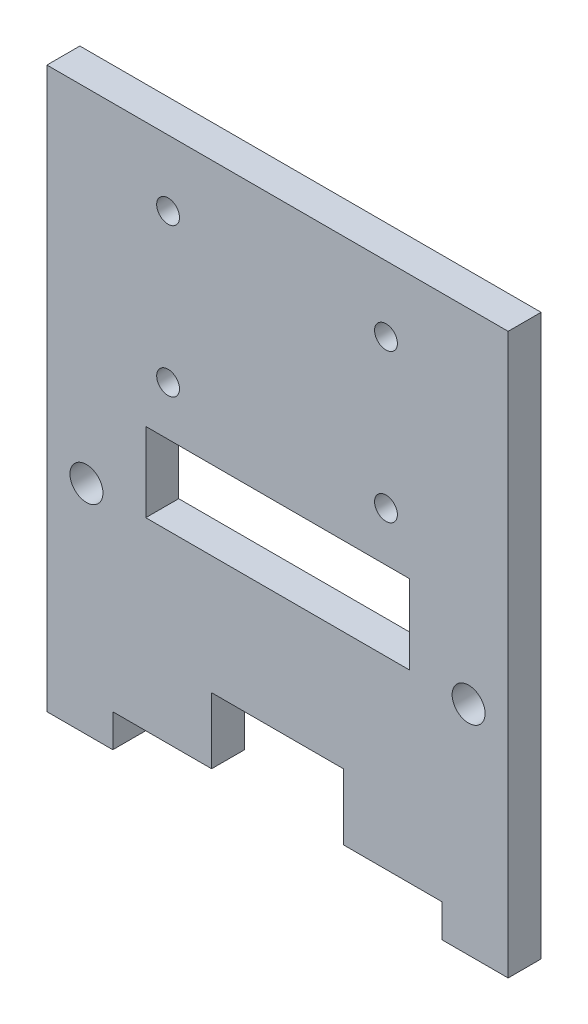
ISO-10303-21;
HEADER;
FILE_DESCRIPTION(('STEP AP214'),'2;1');
FILE_NAME('part.step','',(''),(''),'','','');
FILE_SCHEMA(('AUTOMOTIVE_DESIGN { 1 0 10303 214 1 1 1 1 }'));
ENDSEC;
DATA;
#1=APPLICATION_CONTEXT('core data for automotive mechanical design processes');
#2=APPLICATION_PROTOCOL_DEFINITION('international standard','automotive_design',2000,#1);
#3=PRODUCT_CONTEXT('',#1,'mechanical');
#4=PRODUCT('Part','Part','',(#3));
#5=PRODUCT_RELATED_PRODUCT_CATEGORY('part','',(#4));
#6=PRODUCT_DEFINITION_FORMATION('','',#4);
#7=PRODUCT_DEFINITION_CONTEXT('part definition',#1,'design');
#8=PRODUCT_DEFINITION('design','',#6,#7);
#9=PRODUCT_DEFINITION_SHAPE('','',#8);
#10=(LENGTH_UNIT() NAMED_UNIT(*) SI_UNIT(.MILLI.,.METRE.));
#11=(NAMED_UNIT(*) PLANE_ANGLE_UNIT() SI_UNIT($,.RADIAN.));
#12=(NAMED_UNIT(*) SI_UNIT($,.STERADIAN.) SOLID_ANGLE_UNIT());
#13=UNCERTAINTY_MEASURE_WITH_UNIT(LENGTH_MEASURE(1.E-05),#10,'distance_accuracy_value','');
#14=(GEOMETRIC_REPRESENTATION_CONTEXT(3) GLOBAL_UNCERTAINTY_ASSIGNED_CONTEXT((#13)) GLOBAL_UNIT_ASSIGNED_CONTEXT((#10,
#11,#12)) REPRESENTATION_CONTEXT('',''));
#15=CARTESIAN_POINT('',(0.,0.,0.));
#16=DIRECTION('',(0.,0.,1.));
#17=DIRECTION('',(1.,0.,0.));
#18=AXIS2_PLACEMENT_3D('',#15,#16,#17);
#19=CARTESIAN_POINT('',(6.35,3.175,0.));
#20=DIRECTION('',(0.,1.,0.));
#21=DIRECTION('',(0.,0.,1.));
#22=AXIS2_PLACEMENT_3D('',#19,#20,#21);
#23=PLANE('',#22);
#24=DIRECTION('',(-1.,0.,0.));
#25=VECTOR('',#24,1.);
#26=CARTESIAN_POINT('',(6.35,3.175,0.));
#27=LINE('',#26,#25);
#28=CARTESIAN_POINT('',(15.875,3.175,0.));
#29=VERTEX_POINT('',#28);
#30=CARTESIAN_POINT('',(6.35,3.175,0.));
#31=VERTEX_POINT('',#30);
#32=EDGE_CURVE('E241',#29,#31,#27,.T.);
#33=ORIENTED_EDGE('',*,*,#32,.F.);
#34=DIRECTION('',(0.,0.,1.));
#35=VECTOR('',#34,1.);
#36=CARTESIAN_POINT('',(15.875,3.175,0.));
#37=LINE('',#36,#35);
#38=CARTESIAN_POINT('',(15.875,3.175,3.175));
#39=VERTEX_POINT('',#38);
#40=EDGE_CURVE('E206',#29,#39,#37,.T.);
#41=ORIENTED_EDGE('',*,*,#40,.T.);
#42=DIRECTION('',(-1.,0.,0.));
#43=VECTOR('',#42,1.);
#44=CARTESIAN_POINT('',(6.35,3.175,3.175));
#45=LINE('',#44,#43);
#46=CARTESIAN_POINT('',(6.35,3.175,3.175));
#47=VERTEX_POINT('',#46);
#48=EDGE_CURVE('E252',#39,#47,#45,.T.);
#49=ORIENTED_EDGE('',*,*,#48,.T.);
#50=DIRECTION('',(0.,0.,1.));
#51=VECTOR('',#50,1.);
#52=CARTESIAN_POINT('',(6.35,3.175,0.));
#53=LINE('',#52,#51);
#54=EDGE_CURVE('E255',#31,#47,#53,.T.);
#55=ORIENTED_EDGE('',*,*,#54,.F.);
#56=EDGE_LOOP('',(#33,#41,#49,#55));
#57=FACE_BOUND('',#56,.T.);
#58=ADVANCED_FACE('F36',(#57),#23,.F.);
#59=CARTESIAN_POINT('',(0.,0.,3.175));
#60=DIRECTION('',(0.,1.,0.));
#61=DIRECTION('',(-1.,0.,0.));
#62=AXIS2_PLACEMENT_3D('',#59,#60,#61);
#63=PLANE('',#62);
#64=DIRECTION('',(1.,0.,0.));
#65=VECTOR('',#64,1.);
#66=CARTESIAN_POINT('',(0.,0.,0.));
#67=LINE('',#66,#65);
#68=CARTESIAN_POINT('',(0.,0.,0.));
#69=VERTEX_POINT('',#68);
#70=CARTESIAN_POINT('',(6.35,0.,0.));
#71=VERTEX_POINT('',#70);
#72=EDGE_CURVE('E281',#69,#71,#67,.T.);
#73=ORIENTED_EDGE('',*,*,#72,.T.);
#74=DIRECTION('',(0.,0.,1.));
#75=VECTOR('',#74,1.);
#76=CARTESIAN_POINT('',(6.35,0.,0.));
#77=LINE('',#76,#75);
#78=CARTESIAN_POINT('',(6.35,0.,3.175));
#79=VERTEX_POINT('',#78);
#80=EDGE_CURVE('E245',#71,#79,#77,.T.);
#81=ORIENTED_EDGE('',*,*,#80,.T.);
#82=DIRECTION('',(1.,0.,0.));
#83=VECTOR('',#82,1.);
#84=CARTESIAN_POINT('',(0.,0.,3.175));
#85=LINE('',#84,#83);
#86=CARTESIAN_POINT('',(0.,0.,3.175));
#87=VERTEX_POINT('',#86);
#88=EDGE_CURVE('E270',#87,#79,#85,.T.);
#89=ORIENTED_EDGE('',*,*,#88,.F.);
#90=DIRECTION('',(0.,0.,-1.));
#91=VECTOR('',#90,1.);
#92=CARTESIAN_POINT('',(0.,0.,3.175));
#93=LINE('',#92,#91);
#94=EDGE_CURVE('E11',#87,#69,#93,.T.);
#95=ORIENTED_EDGE('',*,*,#94,.T.);
#96=EDGE_LOOP('',(#73,#81,#89,#95));
#97=FACE_BOUND('',#96,.T.);
#98=ADVANCED_FACE('F343',(#97),#63,.F.);
#99=CARTESIAN_POINT('',(0.,0.,3.175));
#100=DIRECTION('',(1.,0.,0.));
#101=DIRECTION('',(0.,0.,-1.));
#102=AXIS2_PLACEMENT_3D('',#99,#100,#101);
#103=PLANE('',#102);
#104=DIRECTION('',(0.,-1.,0.));
#105=VECTOR('',#104,1.);
#106=CARTESIAN_POINT('',(0.,0.,0.));
#107=LINE('',#106,#105);
#108=CARTESIAN_POINT('',(0.,53.975,0.));
#109=VERTEX_POINT('',#108);
#110=EDGE_CURVE('E258',#109,#69,#107,.T.);
#111=ORIENTED_EDGE('',*,*,#110,.T.);
#112=ORIENTED_EDGE('',*,*,#94,.F.);
#113=DIRECTION('',(0.,-1.,0.));
#114=VECTOR('',#113,1.);
#115=CARTESIAN_POINT('',(0.,0.,3.175));
#116=LINE('',#115,#114);
#117=CARTESIAN_POINT('',(0.,53.975,3.175));
#118=VERTEX_POINT('',#117);
#119=EDGE_CURVE('E265',#118,#87,#116,.T.);
#120=ORIENTED_EDGE('',*,*,#119,.F.);
#121=DIRECTION('',(0.,0.,-1.));
#122=VECTOR('',#121,1.);
#123=CARTESIAN_POINT('',(0.,53.975,3.175));
#124=LINE('',#123,#122);
#125=EDGE_CURVE('E277',#118,#109,#124,.T.);
#126=ORIENTED_EDGE('',*,*,#125,.T.);
#127=EDGE_LOOP('',(#111,#112,#120,#126));
#128=FACE_BOUND('',#127,.T.);
#129=ADVANCED_FACE('F38',(#128),#103,.F.);
#130=CARTESIAN_POINT('',(38.1,0.,3.175));
#131=VERTEX_POINT('',#130);
#132=CARTESIAN_POINT('',(44.45,0.,3.175));
#133=VERTEX_POINT('',#132);
#134=EDGE_CURVE('E268',#131,#133,#85,.T.);
#135=ORIENTED_EDGE('',*,*,#134,.F.);
#136=DIRECTION('',(0.,0.,1.));
#137=VECTOR('',#136,1.);
#138=CARTESIAN_POINT('',(38.1,0.,0.));
#139=LINE('',#138,#137);
#140=CARTESIAN_POINT('',(38.1,0.,0.));
#141=VERTEX_POINT('',#140);
#142=EDGE_CURVE('E261',#141,#131,#139,.T.);
#143=ORIENTED_EDGE('',*,*,#142,.F.);
#144=CARTESIAN_POINT('',(44.45,0.,0.));
#145=VERTEX_POINT('',#144);
#146=EDGE_CURVE('E280',#141,#145,#67,.T.);
#147=ORIENTED_EDGE('',*,*,#146,.T.);
#148=DIRECTION('',(0.,0.,-1.));
#149=VECTOR('',#148,1.);
#150=CARTESIAN_POINT('',(44.45,0.,3.175));
#151=LINE('',#150,#149);
#152=EDGE_CURVE('E44',#133,#145,#151,.T.);
#153=ORIENTED_EDGE('',*,*,#152,.F.);
#154=EDGE_LOOP('',(#135,#143,#147,#153));
#155=FACE_BOUND('',#154,.T.);
#156=ADVANCED_FACE('F319',(#155),#63,.F.);
#157=CARTESIAN_POINT('',(44.45,0.,3.175));
#158=DIRECTION('',(-1.,0.,0.));
#159=DIRECTION('',(0.,0.,1.));
#160=AXIS2_PLACEMENT_3D('',#157,#158,#159);
#161=PLANE('',#160);
#162=DIRECTION('',(0.,1.,0.));
#163=VECTOR('',#162,1.);
#164=CARTESIAN_POINT('',(44.45,0.,0.));
#165=LINE('',#164,#163);
#166=CARTESIAN_POINT('',(44.45,53.975,0.));
#167=VERTEX_POINT('',#166);
#168=EDGE_CURVE('E284',#145,#167,#165,.T.);
#169=ORIENTED_EDGE('',*,*,#168,.T.);
#170=DIRECTION('',(0.,0.,-1.));
#171=VECTOR('',#170,1.);
#172=CARTESIAN_POINT('',(44.45,53.975,3.175));
#173=LINE('',#172,#171);
#174=CARTESIAN_POINT('',(44.45,53.975,3.175));
#175=VERTEX_POINT('',#174);
#176=EDGE_CURVE('E289',#175,#167,#173,.T.);
#177=ORIENTED_EDGE('',*,*,#176,.F.);
#178=DIRECTION('',(0.,1.,0.));
#179=VECTOR('',#178,1.);
#180=CARTESIAN_POINT('',(44.45,0.,3.175));
#181=LINE('',#180,#179);
#182=EDGE_CURVE('E273',#133,#175,#181,.T.);
#183=ORIENTED_EDGE('',*,*,#182,.F.);
#184=ORIENTED_EDGE('',*,*,#152,.T.);
#185=EDGE_LOOP('',(#169,#177,#183,#184));
#186=FACE_BOUND('',#185,.T.);
#187=ADVANCED_FACE('F296',(#186),#161,.F.);
#188=CARTESIAN_POINT('',(0.,53.975,3.175));
#189=DIRECTION('',(0.,-1.,0.));
#190=DIRECTION('',(0.,0.,-1.));
#191=AXIS2_PLACEMENT_3D('',#188,#189,#190);
#192=PLANE('',#191);
#193=DIRECTION('',(-1.,0.,0.));
#194=VECTOR('',#193,1.);
#195=CARTESIAN_POINT('',(0.,53.975,0.));
#196=LINE('',#195,#194);
#197=EDGE_CURVE('E269',#167,#109,#196,.T.);
#198=ORIENTED_EDGE('',*,*,#197,.T.);
#199=ORIENTED_EDGE('',*,*,#125,.F.);
#200=DIRECTION('',(-1.,0.,0.));
#201=VECTOR('',#200,1.);
#202=CARTESIAN_POINT('',(0.,53.975,3.175));
#203=LINE('',#202,#201);
#204=EDGE_CURVE('E275',#175,#118,#203,.T.);
#205=ORIENTED_EDGE('',*,*,#204,.F.);
#206=ORIENTED_EDGE('',*,*,#176,.T.);
#207=EDGE_LOOP('',(#198,#199,#205,#206));
#208=FACE_BOUND('',#207,.T.);
#209=ADVANCED_FACE('F307',(#208),#192,.F.);
#210=CARTESIAN_POINT('',(0.,0.,3.175));
#211=DIRECTION('',(0.,0.,-1.));
#212=DIRECTION('',(-1.,0.,0.));
#213=AXIS2_PLACEMENT_3D('',#210,#211,#212);
#214=PLANE('',#213);
#215=CARTESIAN_POINT('',(3.81,20.955,3.175));
#216=DIRECTION('',(0.,0.,1.));
#217=DIRECTION('',(1.,0.,0.));
#218=AXIS2_PLACEMENT_3D('',#215,#216,#217);
#219=CIRCLE('',#218,1.5875);
#220=CARTESIAN_POINT('',(5.3975,20.955,3.175));
#221=VERTEX_POINT('',#220);
#222=EDGE_CURVE('E191',#221,#221,#219,.T.);
#223=ORIENTED_EDGE('',*,*,#222,.F.);
#224=EDGE_LOOP('',(#223));
#225=FACE_BOUND('',#224,.T.);
#226=DIRECTION('',(1.,0.,0.));
#227=VECTOR('',#226,1.);
#228=CARTESIAN_POINT('',(9.52500000000001,20.955,3.175));
#229=LINE('',#228,#227);
#230=CARTESIAN_POINT('',(9.52500000000001,20.955,3.175));
#231=VERTEX_POINT('',#230);
#232=CARTESIAN_POINT('',(34.925,20.955,3.175));
#233=VERTEX_POINT('',#232);
#234=EDGE_CURVE('E179',#231,#233,#229,.T.);
#235=ORIENTED_EDGE('',*,*,#234,.F.);
#236=DIRECTION('',(0.,-1.,0.));
#237=VECTOR('',#236,1.);
#238=CARTESIAN_POINT('',(9.525,28.575,3.175));
#239=LINE('',#238,#237);
#240=CARTESIAN_POINT('',(9.525,28.575,3.175));
#241=VERTEX_POINT('',#240);
#242=EDGE_CURVE('E51',#241,#231,#239,.T.);
#243=ORIENTED_EDGE('',*,*,#242,.F.);
#244=DIRECTION('',(-1.,0.,0.));
#245=VECTOR('',#244,1.);
#246=CARTESIAN_POINT('',(9.525,28.575,3.175));
#247=LINE('',#246,#245);
#248=CARTESIAN_POINT('',(34.925,28.575,3.175));
#249=VERTEX_POINT('',#248);
#250=EDGE_CURVE('E167',#249,#241,#247,.T.);
#251=ORIENTED_EDGE('',*,*,#250,.F.);
#252=DIRECTION('',(0.,1.,0.));
#253=VECTOR('',#252,1.);
#254=CARTESIAN_POINT('',(34.925,28.575,3.175));
#255=LINE('',#254,#253);
#256=EDGE_CURVE('E170',#233,#249,#255,.T.);
#257=ORIENTED_EDGE('',*,*,#256,.F.);
#258=EDGE_LOOP('',(#235,#243,#251,#257));
#259=FACE_BOUND('',#258,.T.);
#260=CARTESIAN_POINT('',(32.6772125959636,33.325,3.175));
#261=DIRECTION('',(0.,0.,1.));
#262=DIRECTION('',(1.,0.,0.));
#263=AXIS2_PLACEMENT_3D('',#260,#261,#262);
#264=CIRCLE('',#263,1.1);
#265=CARTESIAN_POINT('',(33.7772125959636,33.325,3.175));
#266=VERTEX_POINT('',#265);
#267=EDGE_CURVE('E173',#266,#266,#264,.T.);
#268=ORIENTED_EDGE('',*,*,#267,.F.);
#269=EDGE_LOOP('',(#268));
#270=FACE_BOUND('',#269,.T.);
#271=CARTESIAN_POINT('',(32.6772125959636,47.625,3.175));
#272=DIRECTION('',(0.,0.,1.));
#273=DIRECTION('',(1.,0.,0.));
#274=AXIS2_PLACEMENT_3D('',#271,#272,#273);
#275=CIRCLE('',#274,1.1);
#276=CARTESIAN_POINT('',(33.7772125959636,47.625,3.175));
#277=VERTEX_POINT('',#276);
#278=EDGE_CURVE('E424',#277,#277,#275,.T.);
#279=ORIENTED_EDGE('',*,*,#278,.F.);
#280=EDGE_LOOP('',(#279));
#281=FACE_BOUND('',#280,.T.);
#282=CARTESIAN_POINT('',(11.6772125959636,33.325,3.175));
#283=DIRECTION('',(0.,0.,1.));
#284=DIRECTION('',(1.,0.,0.));
#285=AXIS2_PLACEMENT_3D('',#282,#283,#284);
#286=CIRCLE('',#285,1.1);
#287=CARTESIAN_POINT('',(12.7772125959636,33.325,3.175));
#288=VERTEX_POINT('',#287);
#289=EDGE_CURVE('E230',#288,#288,#286,.T.);
#290=ORIENTED_EDGE('',*,*,#289,.F.);
#291=EDGE_LOOP('',(#290));
#292=FACE_BOUND('',#291,.T.);
#293=CARTESIAN_POINT('',(11.6772125959636,47.625,3.175));
#294=DIRECTION('',(0.,0.,1.));
#295=DIRECTION('',(1.,0.,0.));
#296=AXIS2_PLACEMENT_3D('',#293,#294,#295);
#297=CIRCLE('',#296,1.1);
#298=CARTESIAN_POINT('',(12.7772125959636,47.625,3.175));
#299=VERTEX_POINT('',#298);
#300=EDGE_CURVE('E224',#299,#299,#297,.T.);
#301=ORIENTED_EDGE('',*,*,#300,.F.);
#302=EDGE_LOOP('',(#301));
#303=FACE_BOUND('',#302,.T.);
#304=CARTESIAN_POINT('',(40.64,20.955,3.175));
#305=DIRECTION('',(0.,0.,1.));
#306=DIRECTION('',(-1.,0.,0.));
#307=AXIS2_PLACEMENT_3D('',#304,#305,#306);
#308=CIRCLE('',#307,1.58750000000001);
#309=CARTESIAN_POINT('',(39.0525,20.955,3.175));
#310=VERTEX_POINT('',#309);
#311=EDGE_CURVE('E192',#310,#310,#308,.T.);
#312=ORIENTED_EDGE('',*,*,#311,.F.);
#313=EDGE_LOOP('',(#312));
#314=FACE_BOUND('',#313,.T.);
#315=ORIENTED_EDGE('',*,*,#48,.F.);
#316=DIRECTION('',(0.,-1.,0.));
#317=VECTOR('',#316,1.);
#318=CARTESIAN_POINT('',(15.875,3.175,3.175));
#319=LINE('',#318,#317);
#320=CARTESIAN_POINT('',(15.875,9.525,3.175));
#321=VERTEX_POINT('',#320);
#322=EDGE_CURVE('E207',#321,#39,#319,.T.);
#323=ORIENTED_EDGE('',*,*,#322,.F.);
#324=DIRECTION('',(-1.,0.,0.));
#325=VECTOR('',#324,1.);
#326=CARTESIAN_POINT('',(15.875,9.525,3.175));
#327=LINE('',#326,#325);
#328=CARTESIAN_POINT('',(28.575,9.525,3.175));
#329=VERTEX_POINT('',#328);
#330=EDGE_CURVE('E200',#329,#321,#327,.T.);
#331=ORIENTED_EDGE('',*,*,#330,.F.);
#332=DIRECTION('',(0.,1.,0.));
#333=VECTOR('',#332,1.);
#334=CARTESIAN_POINT('',(28.575,3.175,3.175));
#335=LINE('',#334,#333);
#336=CARTESIAN_POINT('',(28.575,3.175,3.175));
#337=VERTEX_POINT('',#336);
#338=EDGE_CURVE('E209',#337,#329,#335,.T.);
#339=ORIENTED_EDGE('',*,*,#338,.F.);
#340=CARTESIAN_POINT('',(38.1,3.175,3.175));
#341=VERTEX_POINT('',#340);
#342=EDGE_CURVE('E238',#341,#337,#45,.T.);
#343=ORIENTED_EDGE('',*,*,#342,.F.);
#344=DIRECTION('',(0.,1.,0.));
#345=VECTOR('',#344,1.);
#346=CARTESIAN_POINT('',(38.1,0.,3.175));
#347=LINE('',#346,#345);
#348=EDGE_CURVE('E248',#131,#341,#347,.T.);
#349=ORIENTED_EDGE('',*,*,#348,.F.);
#350=ORIENTED_EDGE('',*,*,#134,.T.);
#351=ORIENTED_EDGE('',*,*,#182,.T.);
#352=ORIENTED_EDGE('',*,*,#204,.T.);
#353=ORIENTED_EDGE('',*,*,#119,.T.);
#354=ORIENTED_EDGE('',*,*,#88,.T.);
#355=DIRECTION('',(0.,-1.,0.));
#356=VECTOR('',#355,1.);
#357=CARTESIAN_POINT('',(6.35,0.,3.175));
#358=LINE('',#357,#356);
#359=EDGE_CURVE('E246',#47,#79,#358,.T.);
#360=ORIENTED_EDGE('',*,*,#359,.F.);
#361=EDGE_LOOP('',(#315,#323,#331,#339,#343,#349,#350,#351,#352,#353,#354,#360));
#362=FACE_BOUND('',#361,.T.);
#363=ADVANCED_FACE('F314',(#225,#259,#270,#281,#292,#303,#314,#362),#214,.F.);
#364=CARTESIAN_POINT('',(0.,0.,0.));
#365=DIRECTION('',(0.,0.,-1.));
#366=DIRECTION('',(-1.,0.,0.));
#367=AXIS2_PLACEMENT_3D('',#364,#365,#366);
#368=PLANE('',#367);
#369=CARTESIAN_POINT('',(3.81,20.955,0.));
#370=DIRECTION('',(0.,0.,1.));
#371=DIRECTION('',(1.,0.,0.));
#372=AXIS2_PLACEMENT_3D('',#369,#370,#371);
#373=CIRCLE('',#372,1.5875);
#374=CARTESIAN_POINT('',(5.3975,20.955,0.));
#375=VERTEX_POINT('',#374);
#376=EDGE_CURVE('E249',#375,#375,#373,.T.);
#377=ORIENTED_EDGE('',*,*,#376,.T.);
#378=EDGE_LOOP('',(#377));
#379=FACE_BOUND('',#378,.T.);
#380=DIRECTION('',(0.,-1.,0.));
#381=VECTOR('',#380,1.);
#382=CARTESIAN_POINT('',(9.525,28.575,0.));
#383=LINE('',#382,#381);
#384=CARTESIAN_POINT('',(9.525,28.575,0.));
#385=VERTEX_POINT('',#384);
#386=CARTESIAN_POINT('',(9.52500000000001,20.955,0.));
#387=VERTEX_POINT('',#386);
#388=EDGE_CURVE('E151',#385,#387,#383,.T.);
#389=ORIENTED_EDGE('',*,*,#388,.T.);
#390=DIRECTION('',(1.,0.,0.));
#391=VECTOR('',#390,1.);
#392=CARTESIAN_POINT('',(9.52500000000001,20.955,0.));
#393=LINE('',#392,#391);
#394=CARTESIAN_POINT('',(34.925,20.955,0.));
#395=VERTEX_POINT('',#394);
#396=EDGE_CURVE('E160',#387,#395,#393,.T.);
#397=ORIENTED_EDGE('',*,*,#396,.T.);
#398=DIRECTION('',(0.,1.,0.));
#399=VECTOR('',#398,1.);
#400=CARTESIAN_POINT('',(34.925,28.575,0.));
#401=LINE('',#400,#399);
#402=CARTESIAN_POINT('',(34.925,28.575,0.));
#403=VERTEX_POINT('',#402);
#404=EDGE_CURVE('E59',#395,#403,#401,.T.);
#405=ORIENTED_EDGE('',*,*,#404,.T.);
#406=DIRECTION('',(-1.,0.,0.));
#407=VECTOR('',#406,1.);
#408=CARTESIAN_POINT('',(9.525,28.575,0.));
#409=LINE('',#408,#407);
#410=EDGE_CURVE('E157',#403,#385,#409,.T.);
#411=ORIENTED_EDGE('',*,*,#410,.T.);
#412=EDGE_LOOP('',(#389,#397,#405,#411));
#413=FACE_BOUND('',#412,.T.);
#414=CARTESIAN_POINT('',(32.6772125959636,33.325,0.));
#415=DIRECTION('',(0.,0.,1.));
#416=DIRECTION('',(1.,0.,0.));
#417=AXIS2_PLACEMENT_3D('',#414,#415,#416);
#418=CIRCLE('',#417,1.1);
#419=CARTESIAN_POINT('',(33.7772125959636,33.325,0.));
#420=VERTEX_POINT('',#419);
#421=EDGE_CURVE('E426',#420,#420,#418,.T.);
#422=ORIENTED_EDGE('',*,*,#421,.T.);
#423=EDGE_LOOP('',(#422));
#424=FACE_BOUND('',#423,.T.);
#425=CARTESIAN_POINT('',(32.6772125959636,47.625,0.));
#426=DIRECTION('',(0.,0.,1.));
#427=DIRECTION('',(1.,0.,0.));
#428=AXIS2_PLACEMENT_3D('',#425,#426,#427);
#429=CIRCLE('',#428,1.1);
#430=CARTESIAN_POINT('',(33.7772125959636,47.625,0.));
#431=VERTEX_POINT('',#430);
#432=EDGE_CURVE('E233',#431,#431,#429,.T.);
#433=ORIENTED_EDGE('',*,*,#432,.T.);
#434=EDGE_LOOP('',(#433));
#435=FACE_BOUND('',#434,.T.);
#436=CARTESIAN_POINT('',(11.6772125959636,33.325,0.));
#437=DIRECTION('',(0.,0.,1.));
#438=DIRECTION('',(1.,0.,0.));
#439=AXIS2_PLACEMENT_3D('',#436,#437,#438);
#440=CIRCLE('',#439,1.1);
#441=CARTESIAN_POINT('',(12.7772125959636,33.325,0.));
#442=VERTEX_POINT('',#441);
#443=EDGE_CURVE('E227',#442,#442,#440,.T.);
#444=ORIENTED_EDGE('',*,*,#443,.T.);
#445=EDGE_LOOP('',(#444));
#446=FACE_BOUND('',#445,.T.);
#447=CARTESIAN_POINT('',(11.6772125959636,47.625,0.));
#448=DIRECTION('',(0.,0.,1.));
#449=DIRECTION('',(1.,0.,0.));
#450=AXIS2_PLACEMENT_3D('',#447,#448,#449);
#451=CIRCLE('',#450,1.1);
#452=CARTESIAN_POINT('',(12.7772125959636,47.625,0.));
#453=VERTEX_POINT('',#452);
#454=EDGE_CURVE('E210',#453,#453,#451,.T.);
#455=ORIENTED_EDGE('',*,*,#454,.T.);
#456=EDGE_LOOP('',(#455));
#457=FACE_BOUND('',#456,.T.);
#458=DIRECTION('',(0.,-1.,0.));
#459=VECTOR('',#458,1.);
#460=CARTESIAN_POINT('',(15.875,3.175,0.));
#461=LINE('',#460,#459);
#462=CARTESIAN_POINT('',(15.875,9.525,0.));
#463=VERTEX_POINT('',#462);
#464=EDGE_CURVE('E196',#463,#29,#461,.T.);
#465=ORIENTED_EDGE('',*,*,#464,.T.);
#466=ORIENTED_EDGE('',*,*,#32,.T.);
#467=DIRECTION('',(0.,-1.,0.));
#468=VECTOR('',#467,1.);
#469=CARTESIAN_POINT('',(6.35,0.,0.));
#470=LINE('',#469,#468);
#471=EDGE_CURVE('E234',#31,#71,#470,.T.);
#472=ORIENTED_EDGE('',*,*,#471,.T.);
#473=ORIENTED_EDGE('',*,*,#72,.F.);
#474=ORIENTED_EDGE('',*,*,#110,.F.);
#475=ORIENTED_EDGE('',*,*,#197,.F.);
#476=ORIENTED_EDGE('',*,*,#168,.F.);
#477=ORIENTED_EDGE('',*,*,#146,.F.);
#478=DIRECTION('',(0.,1.,0.));
#479=VECTOR('',#478,1.);
#480=CARTESIAN_POINT('',(38.1,0.,0.));
#481=LINE('',#480,#479);
#482=CARTESIAN_POINT('',(38.1,3.175,0.));
#483=VERTEX_POINT('',#482);
#484=EDGE_CURVE('E237',#141,#483,#481,.T.);
#485=ORIENTED_EDGE('',*,*,#484,.T.);
#486=CARTESIAN_POINT('',(28.575,3.175,0.));
#487=VERTEX_POINT('',#486);
#488=EDGE_CURVE('E242',#483,#487,#27,.T.);
#489=ORIENTED_EDGE('',*,*,#488,.T.);
#490=DIRECTION('',(0.,1.,0.));
#491=VECTOR('',#490,1.);
#492=CARTESIAN_POINT('',(28.575,3.175,0.));
#493=LINE('',#492,#491);
#494=CARTESIAN_POINT('',(28.575,9.525,0.));
#495=VERTEX_POINT('',#494);
#496=EDGE_CURVE('E199',#487,#495,#493,.T.);
#497=ORIENTED_EDGE('',*,*,#496,.T.);
#498=DIRECTION('',(-1.,0.,0.));
#499=VECTOR('',#498,1.);
#500=CARTESIAN_POINT('',(15.875,9.525,0.));
#501=LINE('',#500,#499);
#502=EDGE_CURVE('E203',#495,#463,#501,.T.);
#503=ORIENTED_EDGE('',*,*,#502,.T.);
#504=EDGE_LOOP('',(#465,#466,#472,#473,#474,#475,#476,#477,#485,#489,#497,#503));
#505=FACE_BOUND('',#504,.T.);
#506=CARTESIAN_POINT('',(40.64,20.955,0.));
#507=DIRECTION('',(0.,0.,1.));
#508=DIRECTION('',(-1.,0.,0.));
#509=AXIS2_PLACEMENT_3D('',#506,#507,#508);
#510=CIRCLE('',#509,1.58750000000001);
#511=CARTESIAN_POINT('',(39.0525,20.955,0.));
#512=VERTEX_POINT('',#511);
#513=EDGE_CURVE('E188',#512,#512,#510,.T.);
#514=ORIENTED_EDGE('',*,*,#513,.T.);
#515=EDGE_LOOP('',(#514));
#516=FACE_BOUND('',#515,.T.);
#517=ADVANCED_FACE('F164',(#379,#413,#424,#435,#446,#457,#505,#516),#368,.T.);
#518=CARTESIAN_POINT('',(6.35,0.,0.));
#519=DIRECTION('',(-1.,0.,0.));
#520=DIRECTION('',(0.,0.,1.));
#521=AXIS2_PLACEMENT_3D('',#518,#519,#520);
#522=PLANE('',#521);
#523=ORIENTED_EDGE('',*,*,#359,.T.);
#524=ORIENTED_EDGE('',*,*,#80,.F.);
#525=ORIENTED_EDGE('',*,*,#471,.F.);
#526=ORIENTED_EDGE('',*,*,#54,.T.);
#527=EDGE_LOOP('',(#523,#524,#525,#526));
#528=FACE_BOUND('',#527,.T.);
#529=ADVANCED_FACE('F341',(#528),#522,.F.);
#530=ORIENTED_EDGE('',*,*,#342,.T.);
#531=DIRECTION('',(0.,0.,1.));
#532=VECTOR('',#531,1.);
#533=CARTESIAN_POINT('',(28.575,3.175,0.));
#534=LINE('',#533,#532);
#535=EDGE_CURVE('E218',#487,#337,#534,.T.);
#536=ORIENTED_EDGE('',*,*,#535,.F.);
#537=ORIENTED_EDGE('',*,*,#488,.F.);
#538=DIRECTION('',(0.,0.,1.));
#539=VECTOR('',#538,1.);
#540=CARTESIAN_POINT('',(38.1,3.175,0.));
#541=LINE('',#540,#539);
#542=EDGE_CURVE('E259',#483,#341,#541,.T.);
#543=ORIENTED_EDGE('',*,*,#542,.T.);
#544=EDGE_LOOP('',(#530,#536,#537,#543));
#545=FACE_BOUND('',#544,.T.);
#546=ADVANCED_FACE('F325',(#545),#23,.F.);
#547=CARTESIAN_POINT('',(38.1,0.,0.));
#548=DIRECTION('',(1.,0.,0.));
#549=DIRECTION('',(0.,0.,-1.));
#550=AXIS2_PLACEMENT_3D('',#547,#548,#549);
#551=PLANE('',#550);
#552=ORIENTED_EDGE('',*,*,#348,.T.);
#553=ORIENTED_EDGE('',*,*,#542,.F.);
#554=ORIENTED_EDGE('',*,*,#484,.F.);
#555=ORIENTED_EDGE('',*,*,#142,.T.);
#556=EDGE_LOOP('',(#552,#553,#554,#555));
#557=FACE_BOUND('',#556,.T.);
#558=ADVANCED_FACE('F321',(#557),#551,.F.);
#559=CARTESIAN_POINT('',(15.875,3.175,0.));
#560=DIRECTION('',(-1.,0.,0.));
#561=DIRECTION('',(0.,0.,1.));
#562=AXIS2_PLACEMENT_3D('',#559,#560,#561);
#563=PLANE('',#562);
#564=ORIENTED_EDGE('',*,*,#322,.T.);
#565=ORIENTED_EDGE('',*,*,#40,.F.);
#566=ORIENTED_EDGE('',*,*,#464,.F.);
#567=DIRECTION('',(0.,0.,1.));
#568=VECTOR('',#567,1.);
#569=CARTESIAN_POINT('',(15.875,9.525,0.));
#570=LINE('',#569,#568);
#571=EDGE_CURVE('E195',#463,#321,#570,.T.);
#572=ORIENTED_EDGE('',*,*,#571,.T.);
#573=EDGE_LOOP('',(#564,#565,#566,#572));
#574=FACE_BOUND('',#573,.T.);
#575=ADVANCED_FACE('F369',(#574),#563,.F.);
#576=CARTESIAN_POINT('',(15.875,9.525,0.));
#577=DIRECTION('',(0.,1.,0.));
#578=DIRECTION('',(0.,0.,1.));
#579=AXIS2_PLACEMENT_3D('',#576,#577,#578);
#580=PLANE('',#579);
#581=ORIENTED_EDGE('',*,*,#330,.T.);
#582=ORIENTED_EDGE('',*,*,#571,.F.);
#583=ORIENTED_EDGE('',*,*,#502,.F.);
#584=DIRECTION('',(0.,0.,1.));
#585=VECTOR('',#584,1.);
#586=CARTESIAN_POINT('',(28.575,9.525,0.));
#587=LINE('',#586,#585);
#588=EDGE_CURVE('E216',#495,#329,#587,.T.);
#589=ORIENTED_EDGE('',*,*,#588,.T.);
#590=EDGE_LOOP('',(#581,#582,#583,#589));
#591=FACE_BOUND('',#590,.T.);
#592=ADVANCED_FACE('F332',(#591),#580,.F.);
#593=CARTESIAN_POINT('',(28.575,3.175,0.));
#594=DIRECTION('',(1.,0.,0.));
#595=DIRECTION('',(0.,0.,-1.));
#596=AXIS2_PLACEMENT_3D('',#593,#594,#595);
#597=PLANE('',#596);
#598=ORIENTED_EDGE('',*,*,#338,.T.);
#599=ORIENTED_EDGE('',*,*,#588,.F.);
#600=ORIENTED_EDGE('',*,*,#496,.F.);
#601=ORIENTED_EDGE('',*,*,#535,.T.);
#602=EDGE_LOOP('',(#598,#599,#600,#601));
#603=FACE_BOUND('',#602,.T.);
#604=ADVANCED_FACE('F328',(#603),#597,.F.);
#605=CARTESIAN_POINT('',(40.64,20.955,0.));
#606=DIRECTION('',(0.,0.,1.));
#607=DIRECTION('',(1.,0.,0.));
#608=AXIS2_PLACEMENT_3D('',#605,#606,#607);
#609=CYLINDRICAL_SURFACE('',#608,1.58750000000001);
#610=ORIENTED_EDGE('',*,*,#513,.F.);
#611=EDGE_LOOP('',(#610));
#612=FACE_BOUND('',#611,.T.);
#613=ORIENTED_EDGE('',*,*,#311,.T.);
#614=EDGE_LOOP('',(#613));
#615=FACE_BOUND('',#614,.T.);
#616=ADVANCED_FACE('F380',(#612,#615),#609,.F.);
#617=CARTESIAN_POINT('',(11.6772125959636,47.625,0.));
#618=DIRECTION('',(0.,0.,1.));
#619=DIRECTION('',(1.,0.,0.));
#620=AXIS2_PLACEMENT_3D('',#617,#618,#619);
#621=CYLINDRICAL_SURFACE('',#620,1.1);
#622=ORIENTED_EDGE('',*,*,#454,.F.);
#623=EDGE_LOOP('',(#622));
#624=FACE_BOUND('',#623,.T.);
#625=ORIENTED_EDGE('',*,*,#300,.T.);
#626=EDGE_LOOP('',(#625));
#627=FACE_BOUND('',#626,.T.);
#628=ADVANCED_FACE('F376',(#624,#627),#621,.F.);
#629=CARTESIAN_POINT('',(11.6772125959636,33.325,0.));
#630=DIRECTION('',(0.,0.,1.));
#631=DIRECTION('',(1.,0.,0.));
#632=AXIS2_PLACEMENT_3D('',#629,#630,#631);
#633=CYLINDRICAL_SURFACE('',#632,1.1);
#634=ORIENTED_EDGE('',*,*,#443,.F.);
#635=EDGE_LOOP('',(#634));
#636=FACE_BOUND('',#635,.T.);
#637=ORIENTED_EDGE('',*,*,#289,.T.);
#638=EDGE_LOOP('',(#637));
#639=FACE_BOUND('',#638,.T.);
#640=ADVANCED_FACE('F372',(#636,#639),#633,.F.);
#641=CARTESIAN_POINT('',(32.6772125959636,47.625,0.));
#642=DIRECTION('',(0.,0.,1.));
#643=DIRECTION('',(1.,0.,0.));
#644=AXIS2_PLACEMENT_3D('',#641,#642,#643);
#645=CYLINDRICAL_SURFACE('',#644,1.1);
#646=ORIENTED_EDGE('',*,*,#432,.F.);
#647=EDGE_LOOP('',(#646));
#648=FACE_BOUND('',#647,.T.);
#649=ORIENTED_EDGE('',*,*,#278,.T.);
#650=EDGE_LOOP('',(#649));
#651=FACE_BOUND('',#650,.T.);
#652=ADVANCED_FACE('F375',(#648,#651),#645,.F.);
#653=CARTESIAN_POINT('',(32.6772125959636,33.325,0.));
#654=DIRECTION('',(0.,0.,1.));
#655=DIRECTION('',(1.,0.,0.));
#656=AXIS2_PLACEMENT_3D('',#653,#654,#655);
#657=CYLINDRICAL_SURFACE('',#656,1.1);
#658=ORIENTED_EDGE('',*,*,#421,.F.);
#659=EDGE_LOOP('',(#658));
#660=FACE_BOUND('',#659,.T.);
#661=ORIENTED_EDGE('',*,*,#267,.T.);
#662=EDGE_LOOP('',(#661));
#663=FACE_BOUND('',#662,.T.);
#664=ADVANCED_FACE('F394',(#660,#663),#657,.F.);
#665=CARTESIAN_POINT('',(9.525,28.575,0.));
#666=DIRECTION('',(-1.,0.,0.));
#667=DIRECTION('',(0.,-1.,0.));
#668=AXIS2_PLACEMENT_3D('',#665,#666,#667);
#669=PLANE('',#668);
#670=ORIENTED_EDGE('',*,*,#242,.T.);
#671=DIRECTION('',(0.,0.,1.));
#672=VECTOR('',#671,1.);
#673=CARTESIAN_POINT('',(9.52500000000001,20.955,0.));
#674=LINE('',#673,#672);
#675=EDGE_CURVE('E147',#387,#231,#674,.T.);
#676=ORIENTED_EDGE('',*,*,#675,.F.);
#677=ORIENTED_EDGE('',*,*,#388,.F.);
#678=DIRECTION('',(0.,0.,1.));
#679=VECTOR('',#678,1.);
#680=CARTESIAN_POINT('',(9.525,28.575,0.));
#681=LINE('',#680,#679);
#682=EDGE_CURVE('E183',#385,#241,#681,.T.);
#683=ORIENTED_EDGE('',*,*,#682,.T.);
#684=EDGE_LOOP('',(#670,#676,#677,#683));
#685=FACE_BOUND('',#684,.T.);
#686=ADVANCED_FACE('F149',(#685),#669,.F.);
#687=CARTESIAN_POINT('',(9.525,28.575,0.));
#688=DIRECTION('',(0.,1.,0.));
#689=DIRECTION('',(-1.,0.,0.));
#690=AXIS2_PLACEMENT_3D('',#687,#688,#689);
#691=PLANE('',#690);
#692=ORIENTED_EDGE('',*,*,#250,.T.);
#693=ORIENTED_EDGE('',*,*,#682,.F.);
#694=ORIENTED_EDGE('',*,*,#410,.F.);
#695=DIRECTION('',(0.,0.,1.));
#696=VECTOR('',#695,1.);
#697=CARTESIAN_POINT('',(34.925,28.575,0.));
#698=LINE('',#697,#696);
#699=EDGE_CURVE('E185',#403,#249,#698,.T.);
#700=ORIENTED_EDGE('',*,*,#699,.T.);
#701=EDGE_LOOP('',(#692,#693,#694,#700));
#702=FACE_BOUND('',#701,.T.);
#703=ADVANCED_FACE('F393',(#702),#691,.F.);
#704=CARTESIAN_POINT('',(34.925,28.575,0.));
#705=DIRECTION('',(1.,0.,0.));
#706=DIRECTION('',(0.,0.,-1.));
#707=AXIS2_PLACEMENT_3D('',#704,#705,#706);
#708=PLANE('',#707);
#709=ORIENTED_EDGE('',*,*,#256,.T.);
#710=ORIENTED_EDGE('',*,*,#699,.F.);
#711=ORIENTED_EDGE('',*,*,#404,.F.);
#712=DIRECTION('',(0.,0.,1.));
#713=VECTOR('',#712,1.);
#714=CARTESIAN_POINT('',(34.925,20.955,0.));
#715=LINE('',#714,#713);
#716=EDGE_CURVE('E156',#395,#233,#715,.T.);
#717=ORIENTED_EDGE('',*,*,#716,.T.);
#718=EDGE_LOOP('',(#709,#710,#711,#717));
#719=FACE_BOUND('',#718,.T.);
#720=ADVANCED_FACE('F398',(#719),#708,.F.);
#721=CARTESIAN_POINT('',(9.52500000000001,20.955,0.));
#722=DIRECTION('',(0.,-1.,0.));
#723=DIRECTION('',(0.,0.,-1.));
#724=AXIS2_PLACEMENT_3D('',#721,#722,#723);
#725=PLANE('',#724);
#726=ORIENTED_EDGE('',*,*,#234,.T.);
#727=ORIENTED_EDGE('',*,*,#716,.F.);
#728=ORIENTED_EDGE('',*,*,#396,.F.);
#729=ORIENTED_EDGE('',*,*,#675,.T.);
#730=EDGE_LOOP('',(#726,#727,#728,#729));
#731=FACE_BOUND('',#730,.T.);
#732=ADVANCED_FACE('F161',(#731),#725,.F.);
#733=CARTESIAN_POINT('',(3.81,20.955,0.));
#734=DIRECTION('',(0.,0.,1.));
#735=DIRECTION('',(1.,0.,0.));
#736=AXIS2_PLACEMENT_3D('',#733,#734,#735);
#737=CYLINDRICAL_SURFACE('',#736,1.5875);
#738=ORIENTED_EDGE('',*,*,#376,.F.);
#739=EDGE_LOOP('',(#738));
#740=FACE_BOUND('',#739,.T.);
#741=ORIENTED_EDGE('',*,*,#222,.T.);
#742=EDGE_LOOP('',(#741));
#743=FACE_BOUND('',#742,.T.);
#744=ADVANCED_FACE('F397',(#740,#743),#737,.F.);
#745=CLOSED_SHELL('',(#58,#98,#129,#156,#187,#209,#363,#517,#529,#546,#558,#575,#592,#604,#616,
#628,#640,#652,#664,#686,#703,#720,#732,#744));
#746=MANIFOLD_SOLID_BREP('B2',#745);
#747=ADVANCED_BREP_SHAPE_REPRESENTATION('',(#18,#746),#14);
#748=SHAPE_DEFINITION_REPRESENTATION(#9,#747);
ENDSEC;
END-ISO-10303-21;
